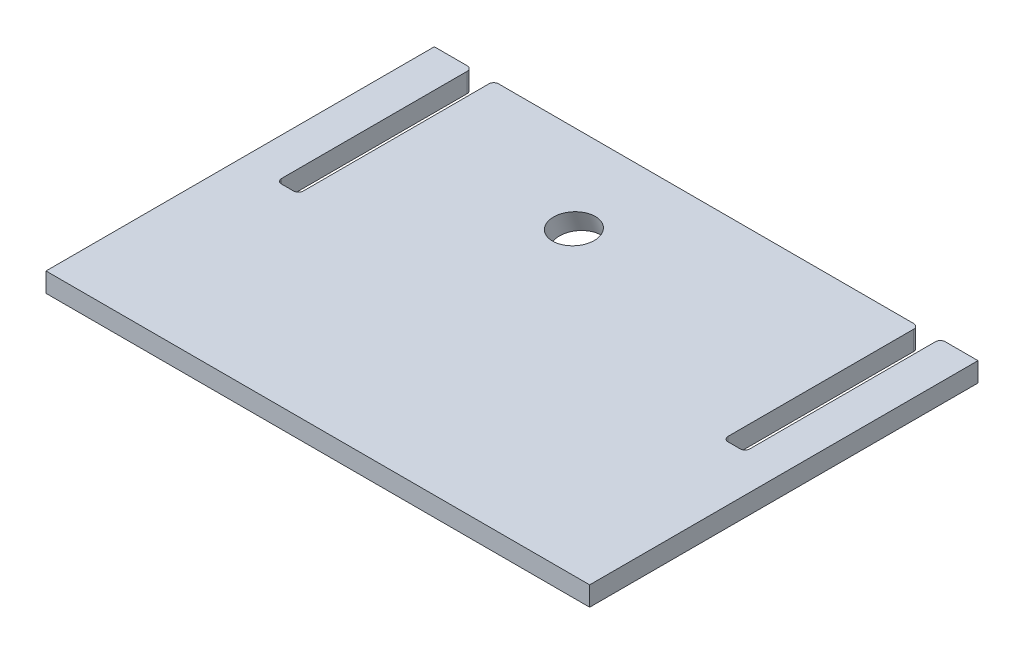
ISO-10303-21;
HEADER;
FILE_DESCRIPTION(('STEP AP214'),'2;1');
FILE_NAME('part.step','',(''),(''),'','','');
FILE_SCHEMA(('AUTOMOTIVE_DESIGN { 1 0 10303 214 1 1 1 1 }'));
ENDSEC;
DATA;
#1=APPLICATION_CONTEXT('core data for automotive mechanical design processes');
#2=APPLICATION_PROTOCOL_DEFINITION('international standard','automotive_design',2000,#1);
#3=PRODUCT_CONTEXT('',#1,'mechanical');
#4=PRODUCT('Part','Part','',(#3));
#5=PRODUCT_RELATED_PRODUCT_CATEGORY('part','',(#4));
#6=PRODUCT_DEFINITION_FORMATION('','',#4);
#7=PRODUCT_DEFINITION_CONTEXT('part definition',#1,'design');
#8=PRODUCT_DEFINITION('design','',#6,#7);
#9=PRODUCT_DEFINITION_SHAPE('','',#8);
#10=(LENGTH_UNIT() NAMED_UNIT(*) SI_UNIT(.MILLI.,.METRE.));
#11=(NAMED_UNIT(*) PLANE_ANGLE_UNIT() SI_UNIT($,.RADIAN.));
#12=(NAMED_UNIT(*) SI_UNIT($,.STERADIAN.) SOLID_ANGLE_UNIT());
#13=UNCERTAINTY_MEASURE_WITH_UNIT(LENGTH_MEASURE(1.E-05),#10,'distance_accuracy_value','');
#14=(GEOMETRIC_REPRESENTATION_CONTEXT(3) GLOBAL_UNCERTAINTY_ASSIGNED_CONTEXT((#13)) GLOBAL_UNIT_ASSIGNED_CONTEXT((#10,
#11,#12)) REPRESENTATION_CONTEXT('',''));
#15=CARTESIAN_POINT('',(0.,0.,0.));
#16=DIRECTION('',(0.,0.,1.));
#17=DIRECTION('',(1.,0.,0.));
#18=AXIS2_PLACEMENT_3D('',#15,#16,#17);
#19=CARTESIAN_POINT('',(-177.8,6.35,-127.));
#20=DIRECTION('',(0.,0.,1.));
#21=DIRECTION('',(1.,0.,0.));
#22=AXIS2_PLACEMENT_3D('',#19,#20,#21);
#23=PLANE('',#22);
#24=DIRECTION('',(-1.,0.,0.));
#25=VECTOR('',#24,1.);
#26=CARTESIAN_POINT('',(-177.8,6.35,-127.));
#27=LINE('',#26,#25);
#28=CARTESIAN_POINT('',(-156.337,6.35,-127.));
#29=VERTEX_POINT('',#28);
#30=CARTESIAN_POINT('',(-177.8,6.35,-127.));
#31=VERTEX_POINT('',#30);
#32=EDGE_CURVE('E229',#29,#31,#27,.T.);
#33=ORIENTED_EDGE('',*,*,#32,.F.);
#34=DIRECTION('',(0.,1.,0.));
#35=VECTOR('',#34,1.);
#36=CARTESIAN_POINT('',(-156.337,6.35,-127.));
#37=LINE('',#36,#35);
#38=CARTESIAN_POINT('',(-156.337,-6.35,-127.));
#39=VERTEX_POINT('',#38);
#40=EDGE_CURVE('E357',#29,#39,#37,.F.);
#41=ORIENTED_EDGE('',*,*,#40,.T.);
#42=DIRECTION('',(-1.,0.,0.));
#43=VECTOR('',#42,1.);
#44=CARTESIAN_POINT('',(-177.8,-6.35,-127.));
#45=LINE('',#44,#43);
#46=CARTESIAN_POINT('',(-177.8,-6.35,-127.));
#47=VERTEX_POINT('',#46);
#48=EDGE_CURVE('E219',#39,#47,#45,.T.);
#49=ORIENTED_EDGE('',*,*,#48,.T.);
#50=DIRECTION('',(0.,-1.,0.));
#51=VECTOR('',#50,1.);
#52=CARTESIAN_POINT('',(-177.8,6.35,-127.));
#53=LINE('',#52,#51);
#54=EDGE_CURVE('E198',#31,#47,#53,.T.);
#55=ORIENTED_EDGE('',*,*,#54,.F.);
#56=EDGE_LOOP('',(#33,#41,#49,#55));
#57=FACE_BOUND('',#56,.T.);
#58=ADVANCED_FACE('F45',(#57),#23,.F.);
#59=CARTESIAN_POINT('',(135.763,6.35,-127.));
#60=VERTEX_POINT('',#59);
#61=CARTESIAN_POINT('',(-135.763,6.35,-127.));
#62=VERTEX_POINT('',#61);
#63=EDGE_CURVE('E234',#60,#62,#27,.T.);
#64=ORIENTED_EDGE('',*,*,#63,.F.);
#65=DIRECTION('',(0.,1.,0.));
#66=VECTOR('',#65,1.);
#67=CARTESIAN_POINT('',(135.763,6.35,-127.));
#68=LINE('',#67,#66);
#69=CARTESIAN_POINT('',(135.763,-6.35,-127.));
#70=VERTEX_POINT('',#69);
#71=EDGE_CURVE('E333',#60,#70,#68,.F.);
#72=ORIENTED_EDGE('',*,*,#71,.T.);
#73=CARTESIAN_POINT('',(-135.763,-6.35,-127.));
#74=VERTEX_POINT('',#73);
#75=EDGE_CURVE('E215',#70,#74,#45,.T.);
#76=ORIENTED_EDGE('',*,*,#75,.T.);
#77=DIRECTION('',(0.,1.,0.));
#78=VECTOR('',#77,1.);
#79=CARTESIAN_POINT('',(-135.763,6.35,-127.));
#80=LINE('',#79,#78);
#81=EDGE_CURVE('E329',#74,#62,#80,.T.);
#82=ORIENTED_EDGE('',*,*,#81,.T.);
#83=EDGE_LOOP('',(#64,#72,#76,#82));
#84=FACE_BOUND('',#83,.T.);
#85=ADVANCED_FACE('F443',(#84),#23,.F.);
#86=CARTESIAN_POINT('',(177.8,6.35,-127.));
#87=DIRECTION('',(-1.,0.,0.));
#88=DIRECTION('',(0.,0.,1.));
#89=AXIS2_PLACEMENT_3D('',#86,#87,#88);
#90=PLANE('',#89);
#91=DIRECTION('',(0.,0.,-1.));
#92=VECTOR('',#91,1.);
#93=CARTESIAN_POINT('',(177.8,-6.35,-127.));
#94=LINE('',#93,#92);
#95=CARTESIAN_POINT('',(177.8,-6.35,127.));
#96=VERTEX_POINT('',#95);
#97=CARTESIAN_POINT('',(177.8,-6.35,-127.));
#98=VERTEX_POINT('',#97);
#99=EDGE_CURVE('E204',#96,#98,#94,.T.);
#100=ORIENTED_EDGE('',*,*,#99,.T.);
#101=DIRECTION('',(0.,-1.,0.));
#102=VECTOR('',#101,1.);
#103=CARTESIAN_POINT('',(177.8,6.35,-127.));
#104=LINE('',#103,#102);
#105=CARTESIAN_POINT('',(177.8,6.35,-127.));
#106=VERTEX_POINT('',#105);
#107=EDGE_CURVE('E390',#106,#98,#104,.T.);
#108=ORIENTED_EDGE('',*,*,#107,.F.);
#109=DIRECTION('',(0.,0.,-1.));
#110=VECTOR('',#109,1.);
#111=CARTESIAN_POINT('',(177.8,6.35,-127.));
#112=LINE('',#111,#110);
#113=CARTESIAN_POINT('',(177.8,6.35,127.));
#114=VERTEX_POINT('',#113);
#115=EDGE_CURVE('E206',#114,#106,#112,.T.);
#116=ORIENTED_EDGE('',*,*,#115,.F.);
#117=DIRECTION('',(0.,-1.,0.));
#118=VECTOR('',#117,1.);
#119=CARTESIAN_POINT('',(177.8,6.35,127.));
#120=LINE('',#119,#118);
#121=EDGE_CURVE('E191',#114,#96,#120,.T.);
#122=ORIENTED_EDGE('',*,*,#121,.T.);
#123=EDGE_LOOP('',(#100,#108,#116,#122));
#124=FACE_BOUND('',#123,.T.);
#125=ADVANCED_FACE('F202',(#124),#90,.F.);
#126=CARTESIAN_POINT('',(156.337,-6.35,-127.));
#127=VERTEX_POINT('',#126);
#128=EDGE_CURVE('E208',#98,#127,#45,.T.);
#129=ORIENTED_EDGE('',*,*,#128,.T.);
#130=DIRECTION('',(0.,1.,0.));
#131=VECTOR('',#130,1.);
#132=CARTESIAN_POINT('',(156.337,6.35,-127.));
#133=LINE('',#132,#131);
#134=CARTESIAN_POINT('',(156.337,6.35,-127.));
#135=VERTEX_POINT('',#134);
#136=EDGE_CURVE('E281',#127,#135,#133,.T.);
#137=ORIENTED_EDGE('',*,*,#136,.T.);
#138=EDGE_CURVE('E230',#106,#135,#27,.T.);
#139=ORIENTED_EDGE('',*,*,#138,.F.);
#140=ORIENTED_EDGE('',*,*,#107,.T.);
#141=EDGE_LOOP('',(#129,#137,#139,#140));
#142=FACE_BOUND('',#141,.T.);
#143=ADVANCED_FACE('F471',(#142),#23,.F.);
#144=CARTESIAN_POINT('',(-177.8,6.35,-127.));
#145=DIRECTION('',(1.,0.,0.));
#146=DIRECTION('',(0.,0.,-1.));
#147=AXIS2_PLACEMENT_3D('',#144,#145,#146);
#148=PLANE('',#147);
#149=DIRECTION('',(0.,0.,1.));
#150=VECTOR('',#149,1.);
#151=CARTESIAN_POINT('',(-177.8,-6.35,-127.));
#152=LINE('',#151,#150);
#153=CARTESIAN_POINT('',(-177.8,-6.35,127.));
#154=VERTEX_POINT('',#153);
#155=EDGE_CURVE('E388',#47,#154,#152,.T.);
#156=ORIENTED_EDGE('',*,*,#155,.T.);
#157=DIRECTION('',(0.,-1.,0.));
#158=VECTOR('',#157,1.);
#159=CARTESIAN_POINT('',(-177.8,6.35,127.));
#160=LINE('',#159,#158);
#161=CARTESIAN_POINT('',(-177.8,6.35,127.));
#162=VERTEX_POINT('',#161);
#163=EDGE_CURVE('E194',#162,#154,#160,.T.);
#164=ORIENTED_EDGE('',*,*,#163,.F.);
#165=DIRECTION('',(0.,0.,1.));
#166=VECTOR('',#165,1.);
#167=CARTESIAN_POINT('',(-177.8,6.35,-127.));
#168=LINE('',#167,#166);
#169=EDGE_CURVE('E226',#31,#162,#168,.T.);
#170=ORIENTED_EDGE('',*,*,#169,.F.);
#171=ORIENTED_EDGE('',*,*,#54,.T.);
#172=EDGE_LOOP('',(#156,#164,#170,#171));
#173=FACE_BOUND('',#172,.T.);
#174=ADVANCED_FACE('F406',(#173),#148,.F.);
#175=CARTESIAN_POINT('',(-177.8,6.35,127.));
#176=DIRECTION('',(0.,0.,-1.));
#177=DIRECTION('',(-1.,0.,0.));
#178=AXIS2_PLACEMENT_3D('',#175,#176,#177);
#179=PLANE('',#178);
#180=DIRECTION('',(1.,0.,0.));
#181=VECTOR('',#180,1.);
#182=CARTESIAN_POINT('',(-177.8,-6.35,127.));
#183=LINE('',#182,#181);
#184=EDGE_CURVE('E187',#154,#96,#183,.T.);
#185=ORIENTED_EDGE('',*,*,#184,.T.);
#186=ORIENTED_EDGE('',*,*,#121,.F.);
#187=DIRECTION('',(1.,0.,0.));
#188=VECTOR('',#187,1.);
#189=CARTESIAN_POINT('',(-177.8,6.35,127.));
#190=LINE('',#189,#188);
#191=EDGE_CURVE('E223',#162,#114,#190,.T.);
#192=ORIENTED_EDGE('',*,*,#191,.F.);
#193=ORIENTED_EDGE('',*,*,#163,.T.);
#194=EDGE_LOOP('',(#185,#186,#192,#193));
#195=FACE_BOUND('',#194,.T.);
#196=ADVANCED_FACE('F189',(#195),#179,.F.);
#197=CARTESIAN_POINT('',(0.,6.35,0.));
#198=DIRECTION('',(0.,1.,0.));
#199=DIRECTION('',(0.,0.,1.));
#200=AXIS2_PLACEMENT_3D('',#197,#198,#199);
#201=PLANE('',#200);
#202=CARTESIAN_POINT('',(-29.0632633217922,6.35,-69.5494140717823));
#203=DIRECTION('',(0.,1.,0.));
#204=DIRECTION('',(0.,0.,1.));
#205=AXIS2_PLACEMENT_3D('',#202,#203,#204);
#206=ELLIPSE('',#205,13.9966885153244,13.335);
#207=CARTESIAN_POINT('',(-29.0632633217924,6.35,-55.552725556458));
#208=VERTEX_POINT('',#207);
#209=EDGE_CURVE('E378',#208,#208,#206,.F.);
#210=ORIENTED_EDGE('',*,*,#209,.T.);
#211=EDGE_LOOP('',(#210));
#212=FACE_BOUND('',#211,.T.);
#213=ORIENTED_EDGE('',*,*,#138,.T.);
#214=CARTESIAN_POINT('',(156.337,6.35,-123.825));
#215=DIRECTION('',(0.,1.,0.));
#216=DIRECTION('',(0.,0.,1.));
#217=AXIS2_PLACEMENT_3D('',#214,#215,#216);
#218=CIRCLE('',#217,3.175);
#219=CARTESIAN_POINT('',(153.162,6.35,-123.825));
#220=VERTEX_POINT('',#219);
#221=EDGE_CURVE('E294',#135,#220,#218,.T.);
#222=ORIENTED_EDGE('',*,*,#221,.T.);
#223=DIRECTION('',(0.,0.,-1.));
#224=VECTOR('',#223,1.);
#225=CARTESIAN_POINT('',(153.162,6.35,0.));
#226=LINE('',#225,#224);
#227=CARTESIAN_POINT('',(153.162,6.35,-2.413));
#228=VERTEX_POINT('',#227);
#229=EDGE_CURVE('E265',#228,#220,#226,.T.);
#230=ORIENTED_EDGE('',*,*,#229,.F.);
#231=CARTESIAN_POINT('',(149.987,6.35,-2.413));
#232=DIRECTION('',(0.,1.,0.));
#233=DIRECTION('',(0.,0.,1.));
#234=AXIS2_PLACEMENT_3D('',#231,#232,#233);
#235=CIRCLE('',#234,3.175);
#236=CARTESIAN_POINT('',(149.987,6.35,0.762));
#237=VERTEX_POINT('',#236);
#238=EDGE_CURVE('E360',#228,#237,#235,.F.);
#239=ORIENTED_EDGE('',*,*,#238,.T.);
#240=DIRECTION('',(1.,0.,0.));
#241=VECTOR('',#240,1.);
#242=CARTESIAN_POINT('',(0.,6.35,0.762));
#243=LINE('',#242,#241);
#244=CARTESIAN_POINT('',(142.113,6.35,0.762));
#245=VERTEX_POINT('',#244);
#246=EDGE_CURVE('E242',#245,#237,#243,.T.);
#247=ORIENTED_EDGE('',*,*,#246,.F.);
#248=CARTESIAN_POINT('',(142.113,6.35,-2.413));
#249=DIRECTION('',(0.,1.,0.));
#250=DIRECTION('',(0.,0.,1.));
#251=AXIS2_PLACEMENT_3D('',#248,#249,#250);
#252=CIRCLE('',#251,3.175);
#253=CARTESIAN_POINT('',(138.938,6.35,-2.413));
#254=VERTEX_POINT('',#253);
#255=EDGE_CURVE('E366',#245,#254,#252,.F.);
#256=ORIENTED_EDGE('',*,*,#255,.T.);
#257=DIRECTION('',(0.,0.,1.));
#258=VECTOR('',#257,1.);
#259=CARTESIAN_POINT('',(138.938,6.35,0.));
#260=LINE('',#259,#258);
#261=CARTESIAN_POINT('',(138.938,6.35,-123.825));
#262=VERTEX_POINT('',#261);
#263=EDGE_CURVE('E266',#262,#254,#260,.T.);
#264=ORIENTED_EDGE('',*,*,#263,.F.);
#265=CARTESIAN_POINT('',(135.763,6.35,-123.825));
#266=DIRECTION('',(0.,1.,0.));
#267=DIRECTION('',(0.,0.,1.));
#268=AXIS2_PLACEMENT_3D('',#265,#266,#267);
#269=CIRCLE('',#268,3.175);
#270=EDGE_CURVE('E291',#262,#60,#269,.T.);
#271=ORIENTED_EDGE('',*,*,#270,.T.);
#272=ORIENTED_EDGE('',*,*,#63,.T.);
#273=CARTESIAN_POINT('',(-135.763,6.35,-123.825));
#274=DIRECTION('',(0.,1.,0.));
#275=DIRECTION('',(0.,0.,1.));
#276=AXIS2_PLACEMENT_3D('',#273,#274,#275);
#277=CIRCLE('',#276,3.175);
#278=CARTESIAN_POINT('',(-138.938,6.35,-123.825));
#279=VERTEX_POINT('',#278);
#280=EDGE_CURVE('E288',#62,#279,#277,.T.);
#281=ORIENTED_EDGE('',*,*,#280,.T.);
#282=DIRECTION('',(0.,0.,-1.));
#283=VECTOR('',#282,1.);
#284=CARTESIAN_POINT('',(-138.938,6.35,0.));
#285=LINE('',#284,#283);
#286=CARTESIAN_POINT('',(-138.938,6.35,-2.41300000000005));
#287=VERTEX_POINT('',#286);
#288=EDGE_CURVE('E241',#287,#279,#285,.T.);
#289=ORIENTED_EDGE('',*,*,#288,.F.);
#290=CARTESIAN_POINT('',(-142.113,6.35,-2.41300000000005));
#291=DIRECTION('',(0.,1.,0.));
#292=DIRECTION('',(0.,0.,1.));
#293=AXIS2_PLACEMENT_3D('',#290,#291,#292);
#294=CIRCLE('',#293,3.175);
#295=CARTESIAN_POINT('',(-142.113,6.35,0.761999999999944));
#296=VERTEX_POINT('',#295);
#297=EDGE_CURVE('E371',#287,#296,#294,.F.);
#298=ORIENTED_EDGE('',*,*,#297,.T.);
#299=DIRECTION('',(1.,0.,0.));
#300=VECTOR('',#299,1.);
#301=CARTESIAN_POINT('',(0.,6.35,0.761999999999944));
#302=LINE('',#301,#300);
#303=CARTESIAN_POINT('',(-149.987,6.35,0.761999999999944));
#304=VERTEX_POINT('',#303);
#305=EDGE_CURVE('E259',#304,#296,#302,.T.);
#306=ORIENTED_EDGE('',*,*,#305,.F.);
#307=CARTESIAN_POINT('',(-149.987,6.35,-2.41300000000006));
#308=DIRECTION('',(0.,1.,0.));
#309=DIRECTION('',(0.,0.,1.));
#310=AXIS2_PLACEMENT_3D('',#307,#308,#309);
#311=CIRCLE('',#310,3.175);
#312=CARTESIAN_POINT('',(-153.162,6.35,-2.41300000000005));
#313=VERTEX_POINT('',#312);
#314=EDGE_CURVE('E55',#304,#313,#311,.F.);
#315=ORIENTED_EDGE('',*,*,#314,.T.);
#316=DIRECTION('',(0.,0.,1.));
#317=VECTOR('',#316,1.);
#318=CARTESIAN_POINT('',(-153.162,6.35,0.));
#319=LINE('',#318,#317);
#320=CARTESIAN_POINT('',(-153.162,6.35,-123.825));
#321=VERTEX_POINT('',#320);
#322=EDGE_CURVE('E237',#321,#313,#319,.T.);
#323=ORIENTED_EDGE('',*,*,#322,.F.);
#324=CARTESIAN_POINT('',(-156.337,6.35,-123.825));
#325=DIRECTION('',(0.,1.,0.));
#326=DIRECTION('',(0.,0.,1.));
#327=AXIS2_PLACEMENT_3D('',#324,#325,#326);
#328=CIRCLE('',#327,3.175);
#329=EDGE_CURVE('E285',#321,#29,#328,.T.);
#330=ORIENTED_EDGE('',*,*,#329,.T.);
#331=ORIENTED_EDGE('',*,*,#32,.T.);
#332=ORIENTED_EDGE('',*,*,#169,.T.);
#333=ORIENTED_EDGE('',*,*,#191,.T.);
#334=ORIENTED_EDGE('',*,*,#115,.T.);
#335=EDGE_LOOP('',(#213,#222,#230,#239,#247,#256,#264,#271,#272,#281,#289,#298,#306,#315,#323,
#330,#331,#332,#333,#334));
#336=FACE_BOUND('',#335,.T.);
#337=ADVANCED_FACE('F408',(#212,#336),#201,.T.);
#338=CARTESIAN_POINT('',(0.,-6.35,0.));
#339=DIRECTION('',(0.,1.,0.));
#340=DIRECTION('',(0.,0.,1.));
#341=AXIS2_PLACEMENT_3D('',#338,#339,#340);
#342=PLANE('',#341);
#343=CARTESIAN_POINT('',(-29.0632633217922,-6.35,-73.5995605538357));
#344=DIRECTION('',(0.,1.,0.));
#345=DIRECTION('',(0.,0.,1.));
#346=AXIS2_PLACEMENT_3D('',#343,#344,#345);
#347=ELLIPSE('',#346,13.9966885153244,13.335);
#348=CARTESIAN_POINT('',(-29.0632633217923,-6.35,-59.6028720385114));
#349=VERTEX_POINT('',#348);
#350=EDGE_CURVE('E49',#349,#349,#347,.F.);
#351=ORIENTED_EDGE('',*,*,#350,.F.);
#352=EDGE_LOOP('',(#351));
#353=FACE_BOUND('',#352,.T.);
#354=DIRECTION('',(0.,0.,-1.));
#355=VECTOR('',#354,1.);
#356=CARTESIAN_POINT('',(153.162,-6.35,0.));
#357=LINE('',#356,#355);
#358=CARTESIAN_POINT('',(153.162,-6.35,-2.413));
#359=VERTEX_POINT('',#358);
#360=CARTESIAN_POINT('',(153.162,-6.35,-123.825));
#361=VERTEX_POINT('',#360);
#362=EDGE_CURVE('E270',#359,#361,#357,.T.);
#363=ORIENTED_EDGE('',*,*,#362,.T.);
#364=CARTESIAN_POINT('',(156.337,-6.35,-123.825));
#365=DIRECTION('',(0.,1.,0.));
#366=DIRECTION('',(0.,0.,1.));
#367=AXIS2_PLACEMENT_3D('',#364,#365,#366);
#368=CIRCLE('',#367,3.175);
#369=EDGE_CURVE('E313',#361,#127,#368,.F.);
#370=ORIENTED_EDGE('',*,*,#369,.T.);
#371=ORIENTED_EDGE('',*,*,#128,.F.);
#372=ORIENTED_EDGE('',*,*,#99,.F.);
#373=ORIENTED_EDGE('',*,*,#184,.F.);
#374=ORIENTED_EDGE('',*,*,#155,.F.);
#375=ORIENTED_EDGE('',*,*,#48,.F.);
#376=CARTESIAN_POINT('',(-156.337,-6.35,-123.825));
#377=DIRECTION('',(0.,1.,0.));
#378=DIRECTION('',(0.,0.,1.));
#379=AXIS2_PLACEMENT_3D('',#376,#377,#378);
#380=CIRCLE('',#379,3.175);
#381=CARTESIAN_POINT('',(-153.162,-6.35,-123.825));
#382=VERTEX_POINT('',#381);
#383=EDGE_CURVE('E304',#39,#382,#380,.F.);
#384=ORIENTED_EDGE('',*,*,#383,.T.);
#385=DIRECTION('',(0.,0.,1.));
#386=VECTOR('',#385,1.);
#387=CARTESIAN_POINT('',(-153.162,-6.35,0.));
#388=LINE('',#387,#386);
#389=CARTESIAN_POINT('',(-153.162,-6.35,-2.41300000000005));
#390=VERTEX_POINT('',#389);
#391=EDGE_CURVE('E243',#382,#390,#388,.T.);
#392=ORIENTED_EDGE('',*,*,#391,.T.);
#393=CARTESIAN_POINT('',(-149.987,-6.35,-2.41300000000006));
#394=DIRECTION('',(0.,1.,0.));
#395=DIRECTION('',(0.,0.,1.));
#396=AXIS2_PLACEMENT_3D('',#393,#394,#395);
#397=CIRCLE('',#396,3.175);
#398=CARTESIAN_POINT('',(-149.987,-6.35,0.761999999999944));
#399=VERTEX_POINT('',#398);
#400=EDGE_CURVE('E12',#390,#399,#397,.T.);
#401=ORIENTED_EDGE('',*,*,#400,.T.);
#402=DIRECTION('',(1.,0.,0.));
#403=VECTOR('',#402,1.);
#404=CARTESIAN_POINT('',(0.,-6.35,0.761999999999944));
#405=LINE('',#404,#403);
#406=CARTESIAN_POINT('',(-142.113,-6.35,0.761999999999944));
#407=VERTEX_POINT('',#406);
#408=EDGE_CURVE('E247',#399,#407,#405,.T.);
#409=ORIENTED_EDGE('',*,*,#408,.T.);
#410=CARTESIAN_POINT('',(-142.113,-6.35,-2.41300000000005));
#411=DIRECTION('',(0.,1.,0.));
#412=DIRECTION('',(0.,0.,1.));
#413=AXIS2_PLACEMENT_3D('',#410,#411,#412);
#414=CIRCLE('',#413,3.175);
#415=CARTESIAN_POINT('',(-138.938,-6.35,-2.41300000000005));
#416=VERTEX_POINT('',#415);
#417=EDGE_CURVE('E374',#407,#416,#414,.T.);
#418=ORIENTED_EDGE('',*,*,#417,.T.);
#419=DIRECTION('',(0.,0.,-1.));
#420=VECTOR('',#419,1.);
#421=CARTESIAN_POINT('',(-138.938,-6.35,0.));
#422=LINE('',#421,#420);
#423=CARTESIAN_POINT('',(-138.938,-6.35,-123.825));
#424=VERTEX_POINT('',#423);
#425=EDGE_CURVE('E251',#416,#424,#422,.T.);
#426=ORIENTED_EDGE('',*,*,#425,.T.);
#427=CARTESIAN_POINT('',(-135.763,-6.35,-123.825));
#428=DIRECTION('',(0.,1.,0.));
#429=DIRECTION('',(0.,0.,1.));
#430=AXIS2_PLACEMENT_3D('',#427,#428,#429);
#431=CIRCLE('',#430,3.175);
#432=EDGE_CURVE('E307',#424,#74,#431,.F.);
#433=ORIENTED_EDGE('',*,*,#432,.T.);
#434=ORIENTED_EDGE('',*,*,#75,.F.);
#435=CARTESIAN_POINT('',(135.763,-6.35,-123.825));
#436=DIRECTION('',(0.,1.,0.));
#437=DIRECTION('',(0.,0.,1.));
#438=AXIS2_PLACEMENT_3D('',#435,#436,#437);
#439=CIRCLE('',#438,3.175);
#440=CARTESIAN_POINT('',(138.938,-6.35,-123.825));
#441=VERTEX_POINT('',#440);
#442=EDGE_CURVE('E310',#70,#441,#439,.F.);
#443=ORIENTED_EDGE('',*,*,#442,.T.);
#444=DIRECTION('',(0.,0.,1.));
#445=VECTOR('',#444,1.);
#446=CARTESIAN_POINT('',(138.938,-6.35,0.));
#447=LINE('',#446,#445);
#448=CARTESIAN_POINT('',(138.938,-6.35,-2.413));
#449=VERTEX_POINT('',#448);
#450=EDGE_CURVE('E255',#441,#449,#447,.T.);
#451=ORIENTED_EDGE('',*,*,#450,.T.);
#452=CARTESIAN_POINT('',(142.113,-6.35,-2.413));
#453=DIRECTION('',(0.,1.,0.));
#454=DIRECTION('',(0.,0.,1.));
#455=AXIS2_PLACEMENT_3D('',#452,#453,#454);
#456=CIRCLE('',#455,3.175);
#457=CARTESIAN_POINT('',(142.113,-6.35,0.762));
#458=VERTEX_POINT('',#457);
#459=EDGE_CURVE('E70',#449,#458,#456,.T.);
#460=ORIENTED_EDGE('',*,*,#459,.T.);
#461=DIRECTION('',(1.,0.,0.));
#462=VECTOR('',#461,1.);
#463=CARTESIAN_POINT('',(0.,-6.35,0.762));
#464=LINE('',#463,#462);
#465=CARTESIAN_POINT('',(149.987,-6.35,0.762));
#466=VERTEX_POINT('',#465);
#467=EDGE_CURVE('E273',#458,#466,#464,.T.);
#468=ORIENTED_EDGE('',*,*,#467,.T.);
#469=CARTESIAN_POINT('',(149.987,-6.35,-2.413));
#470=DIRECTION('',(0.,1.,0.));
#471=DIRECTION('',(0.,0.,1.));
#472=AXIS2_PLACEMENT_3D('',#469,#470,#471);
#473=CIRCLE('',#472,3.175);
#474=EDGE_CURVE('E363',#466,#359,#473,.T.);
#475=ORIENTED_EDGE('',*,*,#474,.T.);
#476=EDGE_LOOP('',(#363,#370,#371,#372,#373,#374,#375,#384,#392,#401,#409,#418,#426,#433,#434,
#443,#451,#460,#468,#475));
#477=FACE_BOUND('',#476,.T.);
#478=ADVANCED_FACE('F211',(#353,#477),#342,.F.);
#479=CARTESIAN_POINT('',(138.938,-6.35,-127.));
#480=DIRECTION('',(-1.,0.,0.));
#481=DIRECTION('',(0.,0.,1.));
#482=AXIS2_PLACEMENT_3D('',#479,#480,#481);
#483=PLANE('',#482);
#484=ORIENTED_EDGE('',*,*,#263,.T.);
#485=DIRECTION('',(0.,1.,0.));
#486=VECTOR('',#485,1.);
#487=CARTESIAN_POINT('',(138.938,-6.35,-2.413));
#488=LINE('',#487,#486);
#489=EDGE_CURVE('E326',#254,#449,#488,.F.);
#490=ORIENTED_EDGE('',*,*,#489,.T.);
#491=ORIENTED_EDGE('',*,*,#450,.F.);
#492=DIRECTION('',(0.,1.,0.));
#493=VECTOR('',#492,1.);
#494=CARTESIAN_POINT('',(138.938,-6.35,-123.825));
#495=LINE('',#494,#493);
#496=EDGE_CURVE('E322',#441,#262,#495,.T.);
#497=ORIENTED_EDGE('',*,*,#496,.T.);
#498=EDGE_LOOP('',(#484,#490,#491,#497));
#499=FACE_BOUND('',#498,.T.);
#500=ADVANCED_FACE('F451',(#499),#483,.F.);
#501=CARTESIAN_POINT('',(153.162,-6.35,-127.));
#502=DIRECTION('',(1.,0.,0.));
#503=DIRECTION('',(0.,0.,-1.));
#504=AXIS2_PLACEMENT_3D('',#501,#502,#503);
#505=PLANE('',#504);
#506=ORIENTED_EDGE('',*,*,#229,.T.);
#507=DIRECTION('',(0.,1.,0.));
#508=VECTOR('',#507,1.);
#509=CARTESIAN_POINT('',(153.162,-6.35,-123.825));
#510=LINE('',#509,#508);
#511=EDGE_CURVE('E301',#220,#361,#510,.F.);
#512=ORIENTED_EDGE('',*,*,#511,.T.);
#513=ORIENTED_EDGE('',*,*,#362,.F.);
#514=DIRECTION('',(0.,1.,0.));
#515=VECTOR('',#514,1.);
#516=CARTESIAN_POINT('',(153.162,6.35,-2.413));
#517=LINE('',#516,#515);
#518=EDGE_CURVE('E297',#359,#228,#517,.T.);
#519=ORIENTED_EDGE('',*,*,#518,.T.);
#520=EDGE_LOOP('',(#506,#512,#513,#519));
#521=FACE_BOUND('',#520,.T.);
#522=ADVANCED_FACE('F466',(#521),#505,.F.);
#523=CARTESIAN_POINT('',(139.7,-6.35,0.762));
#524=DIRECTION('',(0.,0.,1.));
#525=DIRECTION('',(1.,0.,0.));
#526=AXIS2_PLACEMENT_3D('',#523,#524,#525);
#527=PLANE('',#526);
#528=ORIENTED_EDGE('',*,*,#246,.T.);
#529=DIRECTION('',(0.,1.,0.));
#530=VECTOR('',#529,1.);
#531=CARTESIAN_POINT('',(149.987,-6.35,0.762));
#532=LINE('',#531,#530);
#533=EDGE_CURVE('E63',#237,#466,#532,.F.);
#534=ORIENTED_EDGE('',*,*,#533,.T.);
#535=ORIENTED_EDGE('',*,*,#467,.F.);
#536=DIRECTION('',(0.,1.,0.));
#537=VECTOR('',#536,1.);
#538=CARTESIAN_POINT('',(142.113,6.35,0.762));
#539=LINE('',#538,#537);
#540=EDGE_CURVE('E316',#458,#245,#539,.T.);
#541=ORIENTED_EDGE('',*,*,#540,.T.);
#542=EDGE_LOOP('',(#528,#534,#535,#541));
#543=FACE_BOUND('',#542,.T.);
#544=ADVANCED_FACE('F458',(#543),#527,.F.);
#545=CARTESIAN_POINT('',(-153.162,-6.35,-127.));
#546=DIRECTION('',(-1.,0.,0.));
#547=DIRECTION('',(0.,0.,1.));
#548=AXIS2_PLACEMENT_3D('',#545,#546,#547);
#549=PLANE('',#548);
#550=ORIENTED_EDGE('',*,*,#322,.T.);
#551=DIRECTION('',(0.,1.,0.));
#552=VECTOR('',#551,1.);
#553=CARTESIAN_POINT('',(-153.162,-6.35,-2.41300000000005));
#554=LINE('',#553,#552);
#555=EDGE_CURVE('E354',#313,#390,#554,.F.);
#556=ORIENTED_EDGE('',*,*,#555,.T.);
#557=ORIENTED_EDGE('',*,*,#391,.F.);
#558=DIRECTION('',(0.,1.,0.));
#559=VECTOR('',#558,1.);
#560=CARTESIAN_POINT('',(-153.162,-6.35,-123.825));
#561=LINE('',#560,#559);
#562=EDGE_CURVE('E350',#382,#321,#561,.T.);
#563=ORIENTED_EDGE('',*,*,#562,.T.);
#564=EDGE_LOOP('',(#550,#556,#557,#563));
#565=FACE_BOUND('',#564,.T.);
#566=ADVANCED_FACE('F416',(#565),#549,.F.);
#567=CARTESIAN_POINT('',(-138.938,-6.35,-127.));
#568=DIRECTION('',(1.,0.,0.));
#569=DIRECTION('',(0.,0.,-1.));
#570=AXIS2_PLACEMENT_3D('',#567,#568,#569);
#571=PLANE('',#570);
#572=ORIENTED_EDGE('',*,*,#288,.T.);
#573=DIRECTION('',(0.,1.,0.));
#574=VECTOR('',#573,1.);
#575=CARTESIAN_POINT('',(-138.938,-6.35,-123.825));
#576=LINE('',#575,#574);
#577=EDGE_CURVE('E340',#279,#424,#576,.F.);
#578=ORIENTED_EDGE('',*,*,#577,.T.);
#579=ORIENTED_EDGE('',*,*,#425,.F.);
#580=DIRECTION('',(0.,1.,0.));
#581=VECTOR('',#580,1.);
#582=CARTESIAN_POINT('',(-138.938,6.35,-2.41300000000005));
#583=LINE('',#582,#581);
#584=EDGE_CURVE('E336',#416,#287,#583,.T.);
#585=ORIENTED_EDGE('',*,*,#584,.T.);
#586=EDGE_LOOP('',(#572,#578,#579,#585));
#587=FACE_BOUND('',#586,.T.);
#588=ADVANCED_FACE('F433',(#587),#571,.F.);
#589=CARTESIAN_POINT('',(-152.4,-6.35,0.761999999999944));
#590=DIRECTION('',(0.,0.,1.));
#591=DIRECTION('',(1.,0.,0.));
#592=AXIS2_PLACEMENT_3D('',#589,#590,#591);
#593=PLANE('',#592);
#594=ORIENTED_EDGE('',*,*,#305,.T.);
#595=DIRECTION('',(0.,1.,0.));
#596=VECTOR('',#595,1.);
#597=CARTESIAN_POINT('',(-142.113,-6.35,0.761999999999944));
#598=LINE('',#597,#596);
#599=EDGE_CURVE('E347',#296,#407,#598,.F.);
#600=ORIENTED_EDGE('',*,*,#599,.T.);
#601=ORIENTED_EDGE('',*,*,#408,.F.);
#602=DIRECTION('',(0.,1.,0.));
#603=VECTOR('',#602,1.);
#604=CARTESIAN_POINT('',(-149.987,6.35,0.761999999999944));
#605=LINE('',#604,#603);
#606=EDGE_CURVE('E343',#399,#304,#605,.T.);
#607=ORIENTED_EDGE('',*,*,#606,.T.);
#608=EDGE_LOOP('',(#594,#600,#601,#607));
#609=FACE_BOUND('',#608,.T.);
#610=ADVANCED_FACE('F424',(#609),#593,.F.);
#611=CARTESIAN_POINT('',(-29.0632633217921,-44.450000000002,-85.7499999999964));
#612=DIRECTION('',(0.,0.952725352528927,0.303832853142369));
#613=DIRECTION('',(0.,0.303832853142369,-0.952725352528927));
#614=AXIS2_PLACEMENT_3D('',#611,#612,#613);
#615=CYLINDRICAL_SURFACE('',#614,13.335);
#616=ORIENTED_EDGE('',*,*,#209,.F.);
#617=EDGE_LOOP('',(#616));
#618=FACE_BOUND('',#617,.T.);
#619=ORIENTED_EDGE('',*,*,#350,.T.);
#620=EDGE_LOOP('',(#619));
#621=FACE_BOUND('',#620,.T.);
#622=ADVANCED_FACE('F47',(#618,#621),#615,.F.);
#623=CARTESIAN_POINT('',(156.337,6.35,-123.825));
#624=DIRECTION('',(0.,1.,0.));
#625=DIRECTION('',(0.,0.,1.));
#626=AXIS2_PLACEMENT_3D('',#623,#624,#625);
#627=CYLINDRICAL_SURFACE('',#626,3.175);
#628=ORIENTED_EDGE('',*,*,#369,.F.);
#629=ORIENTED_EDGE('',*,*,#511,.F.);
#630=ORIENTED_EDGE('',*,*,#221,.F.);
#631=ORIENTED_EDGE('',*,*,#136,.F.);
#632=EDGE_LOOP('',(#628,#629,#630,#631));
#633=FACE_BOUND('',#632,.T.);
#634=ADVANCED_FACE('F470',(#633),#627,.T.);
#635=CARTESIAN_POINT('',(149.987,-6.35,-2.413));
#636=DIRECTION('',(0.,-1.,0.));
#637=DIRECTION('',(0.,0.,-1.));
#638=AXIS2_PLACEMENT_3D('',#635,#636,#637);
#639=CYLINDRICAL_SURFACE('',#638,3.175);
#640=ORIENTED_EDGE('',*,*,#474,.F.);
#641=ORIENTED_EDGE('',*,*,#533,.F.);
#642=ORIENTED_EDGE('',*,*,#238,.F.);
#643=ORIENTED_EDGE('',*,*,#518,.F.);
#644=EDGE_LOOP('',(#640,#641,#642,#643));
#645=FACE_BOUND('',#644,.T.);
#646=ADVANCED_FACE('F463',(#645),#639,.F.);
#647=CARTESIAN_POINT('',(142.113,-6.35,-2.413));
#648=DIRECTION('',(0.,-1.,0.));
#649=DIRECTION('',(0.,0.,-1.));
#650=AXIS2_PLACEMENT_3D('',#647,#648,#649);
#651=CYLINDRICAL_SURFACE('',#650,3.175);
#652=ORIENTED_EDGE('',*,*,#459,.F.);
#653=ORIENTED_EDGE('',*,*,#489,.F.);
#654=ORIENTED_EDGE('',*,*,#255,.F.);
#655=ORIENTED_EDGE('',*,*,#540,.F.);
#656=EDGE_LOOP('',(#652,#653,#654,#655));
#657=FACE_BOUND('',#656,.T.);
#658=ADVANCED_FACE('F455',(#657),#651,.F.);
#659=CARTESIAN_POINT('',(135.763,-6.35,-123.825));
#660=DIRECTION('',(0.,1.,0.));
#661=DIRECTION('',(0.,0.,1.));
#662=AXIS2_PLACEMENT_3D('',#659,#660,#661);
#663=CYLINDRICAL_SURFACE('',#662,3.175);
#664=ORIENTED_EDGE('',*,*,#442,.F.);
#665=ORIENTED_EDGE('',*,*,#71,.F.);
#666=ORIENTED_EDGE('',*,*,#270,.F.);
#667=ORIENTED_EDGE('',*,*,#496,.F.);
#668=EDGE_LOOP('',(#664,#665,#666,#667));
#669=FACE_BOUND('',#668,.T.);
#670=ADVANCED_FACE('F447',(#669),#663,.T.);
#671=CARTESIAN_POINT('',(-135.763,6.35,-123.825));
#672=DIRECTION('',(0.,1.,0.));
#673=DIRECTION('',(0.,0.,1.));
#674=AXIS2_PLACEMENT_3D('',#671,#672,#673);
#675=CYLINDRICAL_SURFACE('',#674,3.175);
#676=ORIENTED_EDGE('',*,*,#432,.F.);
#677=ORIENTED_EDGE('',*,*,#577,.F.);
#678=ORIENTED_EDGE('',*,*,#280,.F.);
#679=ORIENTED_EDGE('',*,*,#81,.F.);
#680=EDGE_LOOP('',(#676,#677,#678,#679));
#681=FACE_BOUND('',#680,.T.);
#682=ADVANCED_FACE('F437',(#681),#675,.T.);
#683=CARTESIAN_POINT('',(-142.113,-6.35,-2.41300000000005));
#684=DIRECTION('',(0.,-1.,0.));
#685=DIRECTION('',(0.,0.,-1.));
#686=AXIS2_PLACEMENT_3D('',#683,#684,#685);
#687=CYLINDRICAL_SURFACE('',#686,3.175);
#688=ORIENTED_EDGE('',*,*,#417,.F.);
#689=ORIENTED_EDGE('',*,*,#599,.F.);
#690=ORIENTED_EDGE('',*,*,#297,.F.);
#691=ORIENTED_EDGE('',*,*,#584,.F.);
#692=EDGE_LOOP('',(#688,#689,#690,#691));
#693=FACE_BOUND('',#692,.T.);
#694=ADVANCED_FACE('F428',(#693),#687,.F.);
#695=CARTESIAN_POINT('',(-149.987,-6.35,-2.41300000000006));
#696=DIRECTION('',(0.,-1.,0.));
#697=DIRECTION('',(0.,0.,-1.));
#698=AXIS2_PLACEMENT_3D('',#695,#696,#697);
#699=CYLINDRICAL_SURFACE('',#698,3.175);
#700=ORIENTED_EDGE('',*,*,#400,.F.);
#701=ORIENTED_EDGE('',*,*,#555,.F.);
#702=ORIENTED_EDGE('',*,*,#314,.F.);
#703=ORIENTED_EDGE('',*,*,#606,.F.);
#704=EDGE_LOOP('',(#700,#701,#702,#703));
#705=FACE_BOUND('',#704,.T.);
#706=ADVANCED_FACE('F419',(#705),#699,.F.);
#707=CARTESIAN_POINT('',(-156.337,-6.35,-123.825));
#708=DIRECTION('',(0.,1.,0.));
#709=DIRECTION('',(0.,0.,1.));
#710=AXIS2_PLACEMENT_3D('',#707,#708,#709);
#711=CYLINDRICAL_SURFACE('',#710,3.175);
#712=ORIENTED_EDGE('',*,*,#383,.F.);
#713=ORIENTED_EDGE('',*,*,#40,.F.);
#714=ORIENTED_EDGE('',*,*,#329,.F.);
#715=ORIENTED_EDGE('',*,*,#562,.F.);
#716=EDGE_LOOP('',(#712,#713,#714,#715));
#717=FACE_BOUND('',#716,.T.);
#718=ADVANCED_FACE('F411',(#717),#711,.T.);
#719=CLOSED_SHELL('',(#58,#85,#125,#143,#174,#196,#337,#478,#500,#522,#544,#566,#588,#610,#622,
#634,#646,#658,#670,#682,#694,#706,#718));
#720=MANIFOLD_SOLID_BREP('B2',#719);
#721=ADVANCED_BREP_SHAPE_REPRESENTATION('',(#18,#720),#14);
#722=SHAPE_DEFINITION_REPRESENTATION(#9,#721);
ENDSEC;
END-ISO-10303-21;
